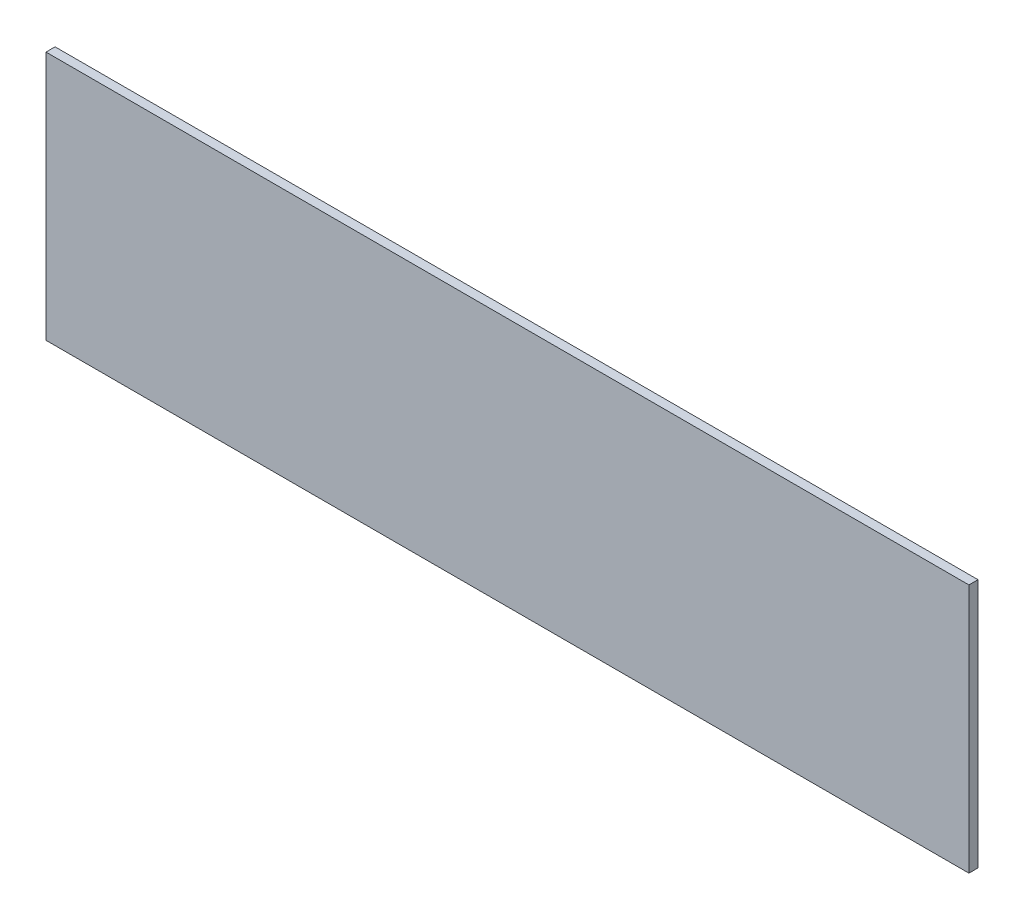
ISO-10303-21;
HEADER;
FILE_DESCRIPTION(('STEP AP214'),'2;1');
FILE_NAME('part.step','',(''),(''),'','','');
FILE_SCHEMA(('AUTOMOTIVE_DESIGN { 1 0 10303 214 1 1 1 1 }'));
ENDSEC;
DATA;
#1=APPLICATION_CONTEXT('core data for automotive mechanical design processes');
#2=APPLICATION_PROTOCOL_DEFINITION('international standard','automotive_design',2000,#1);
#3=PRODUCT_CONTEXT('',#1,'mechanical');
#4=PRODUCT('Part','Part','',(#3));
#5=PRODUCT_RELATED_PRODUCT_CATEGORY('part','',(#4));
#6=PRODUCT_DEFINITION_FORMATION('','',#4);
#7=PRODUCT_DEFINITION_CONTEXT('part definition',#1,'design');
#8=PRODUCT_DEFINITION('design','',#6,#7);
#9=PRODUCT_DEFINITION_SHAPE('','',#8);
#10=(LENGTH_UNIT() NAMED_UNIT(*) SI_UNIT(.MILLI.,.METRE.));
#11=(NAMED_UNIT(*) PLANE_ANGLE_UNIT() SI_UNIT($,.RADIAN.));
#12=(NAMED_UNIT(*) SI_UNIT($,.STERADIAN.) SOLID_ANGLE_UNIT());
#13=UNCERTAINTY_MEASURE_WITH_UNIT(LENGTH_MEASURE(1.E-05),#10,'distance_accuracy_value','');
#14=(GEOMETRIC_REPRESENTATION_CONTEXT(3) GLOBAL_UNCERTAINTY_ASSIGNED_CONTEXT((#13)) GLOBAL_UNIT_ASSIGNED_CONTEXT((#10,
#11,#12)) REPRESENTATION_CONTEXT('',''));
#15=CARTESIAN_POINT('',(0.,0.,0.));
#16=DIRECTION('',(0.,0.,1.));
#17=DIRECTION('',(1.,0.,0.));
#18=AXIS2_PLACEMENT_3D('',#15,#16,#17);
#19=CARTESIAN_POINT('',(0.,0.,3.));
#20=DIRECTION('',(1.,0.,0.));
#21=DIRECTION('',(0.,0.,-1.));
#22=AXIS2_PLACEMENT_3D('',#19,#20,#21);
#23=PLANE('',#22);
#24=DIRECTION('',(0.,-1.,0.));
#25=VECTOR('',#24,1.);
#26=CARTESIAN_POINT('',(0.,0.,0.));
#27=LINE('',#26,#25);
#28=CARTESIAN_POINT('',(0.,82.5,0.));
#29=VERTEX_POINT('',#28);
#30=CARTESIAN_POINT('',(0.,0.,0.));
#31=VERTEX_POINT('',#30);
#32=EDGE_CURVE('E97',#29,#31,#27,.T.);
#33=ORIENTED_EDGE('',*,*,#32,.T.);
#34=DIRECTION('',(0.,0.,-1.));
#35=VECTOR('',#34,1.);
#36=CARTESIAN_POINT('',(0.,0.,3.));
#37=LINE('',#36,#35);
#38=CARTESIAN_POINT('',(0.,0.,3.));
#39=VERTEX_POINT('',#38);
#40=EDGE_CURVE('E11',#39,#31,#37,.T.);
#41=ORIENTED_EDGE('',*,*,#40,.F.);
#42=DIRECTION('',(0.,-1.,0.));
#43=VECTOR('',#42,1.);
#44=CARTESIAN_POINT('',(0.,0.,3.));
#45=LINE('',#44,#43);
#46=CARTESIAN_POINT('',(0.,82.5,3.));
#47=VERTEX_POINT('',#46);
#48=EDGE_CURVE('E85',#47,#39,#45,.T.);
#49=ORIENTED_EDGE('',*,*,#48,.F.);
#50=DIRECTION('',(0.,0.,-1.));
#51=VECTOR('',#50,1.);
#52=CARTESIAN_POINT('',(0.,82.5,3.));
#53=LINE('',#52,#51);
#54=EDGE_CURVE('E93',#47,#29,#53,.T.);
#55=ORIENTED_EDGE('',*,*,#54,.T.);
#56=EDGE_LOOP('',(#33,#41,#49,#55));
#57=FACE_BOUND('',#56,.T.);
#58=ADVANCED_FACE('F34',(#57),#23,.F.);
#59=CARTESIAN_POINT('',(0.,0.,3.));
#60=DIRECTION('',(0.,1.,0.));
#61=DIRECTION('',(0.,0.,1.));
#62=AXIS2_PLACEMENT_3D('',#59,#60,#61);
#63=PLANE('',#62);
#64=DIRECTION('',(1.,0.,0.));
#65=VECTOR('',#64,1.);
#66=CARTESIAN_POINT('',(0.,0.,0.));
#67=LINE('',#66,#65);
#68=CARTESIAN_POINT('',(305.,0.,0.));
#69=VERTEX_POINT('',#68);
#70=EDGE_CURVE('E89',#31,#69,#67,.T.);
#71=ORIENTED_EDGE('',*,*,#70,.T.);
#72=DIRECTION('',(0.,0.,-1.));
#73=VECTOR('',#72,1.);
#74=CARTESIAN_POINT('',(305.,0.,3.));
#75=LINE('',#74,#73);
#76=CARTESIAN_POINT('',(305.,0.,3.));
#77=VERTEX_POINT('',#76);
#78=EDGE_CURVE('E42',#77,#69,#75,.T.);
#79=ORIENTED_EDGE('',*,*,#78,.F.);
#80=DIRECTION('',(1.,0.,0.));
#81=VECTOR('',#80,1.);
#82=CARTESIAN_POINT('',(0.,0.,3.));
#83=LINE('',#82,#81);
#84=EDGE_CURVE('E80',#39,#77,#83,.T.);
#85=ORIENTED_EDGE('',*,*,#84,.F.);
#86=ORIENTED_EDGE('',*,*,#40,.T.);
#87=EDGE_LOOP('',(#71,#79,#85,#86));
#88=FACE_BOUND('',#87,.T.);
#89=ADVANCED_FACE('F88',(#88),#63,.F.);
#90=CARTESIAN_POINT('',(305.,0.,3.));
#91=DIRECTION('',(-1.,0.,0.));
#92=DIRECTION('',(0.,0.,1.));
#93=AXIS2_PLACEMENT_3D('',#90,#91,#92);
#94=PLANE('',#93);
#95=DIRECTION('',(0.,1.,0.));
#96=VECTOR('',#95,1.);
#97=CARTESIAN_POINT('',(305.,0.,0.));
#98=LINE('',#97,#96);
#99=CARTESIAN_POINT('',(305.,82.5,0.));
#100=VERTEX_POINT('',#99);
#101=EDGE_CURVE('E67',#69,#100,#98,.T.);
#102=ORIENTED_EDGE('',*,*,#101,.T.);
#103=DIRECTION('',(0.,0.,-1.));
#104=VECTOR('',#103,1.);
#105=CARTESIAN_POINT('',(305.,82.5,3.));
#106=LINE('',#105,#104);
#107=CARTESIAN_POINT('',(305.,82.5,3.));
#108=VERTEX_POINT('',#107);
#109=EDGE_CURVE('E90',#108,#100,#106,.T.);
#110=ORIENTED_EDGE('',*,*,#109,.F.);
#111=DIRECTION('',(0.,1.,0.));
#112=VECTOR('',#111,1.);
#113=CARTESIAN_POINT('',(305.,0.,3.));
#114=LINE('',#113,#112);
#115=EDGE_CURVE('E83',#77,#108,#114,.T.);
#116=ORIENTED_EDGE('',*,*,#115,.F.);
#117=ORIENTED_EDGE('',*,*,#78,.T.);
#118=EDGE_LOOP('',(#102,#110,#116,#117));
#119=FACE_BOUND('',#118,.T.);
#120=ADVANCED_FACE('F91',(#119),#94,.F.);
#121=CARTESIAN_POINT('',(0.,82.5,3.));
#122=DIRECTION('',(0.,-1.,0.));
#123=DIRECTION('',(0.,0.,-1.));
#124=AXIS2_PLACEMENT_3D('',#121,#122,#123);
#125=PLANE('',#124);
#126=DIRECTION('',(-1.,0.,0.));
#127=VECTOR('',#126,1.);
#128=CARTESIAN_POINT('',(0.,82.5,0.));
#129=LINE('',#128,#127);
#130=EDGE_CURVE('E73',#100,#29,#129,.T.);
#131=ORIENTED_EDGE('',*,*,#130,.T.);
#132=ORIENTED_EDGE('',*,*,#54,.F.);
#133=DIRECTION('',(-1.,0.,0.));
#134=VECTOR('',#133,1.);
#135=CARTESIAN_POINT('',(0.,82.5,3.));
#136=LINE('',#135,#134);
#137=EDGE_CURVE('E50',#108,#47,#136,.T.);
#138=ORIENTED_EDGE('',*,*,#137,.F.);
#139=ORIENTED_EDGE('',*,*,#109,.T.);
#140=EDGE_LOOP('',(#131,#132,#138,#139));
#141=FACE_BOUND('',#140,.T.);
#142=ADVANCED_FACE('F104',(#141),#125,.F.);
#143=CARTESIAN_POINT('',(0.,0.,3.));
#144=DIRECTION('',(0.,0.,-1.));
#145=DIRECTION('',(-1.,0.,0.));
#146=AXIS2_PLACEMENT_3D('',#143,#144,#145);
#147=PLANE('',#146);
#148=ORIENTED_EDGE('',*,*,#48,.T.);
#149=ORIENTED_EDGE('',*,*,#84,.T.);
#150=ORIENTED_EDGE('',*,*,#115,.T.);
#151=ORIENTED_EDGE('',*,*,#137,.T.);
#152=EDGE_LOOP('',(#148,#149,#150,#151));
#153=FACE_BOUND('',#152,.T.);
#154=ADVANCED_FACE('F81',(#153),#147,.F.);
#155=CARTESIAN_POINT('',(0.,0.,0.));
#156=DIRECTION('',(0.,0.,-1.));
#157=DIRECTION('',(-1.,0.,0.));
#158=AXIS2_PLACEMENT_3D('',#155,#156,#157);
#159=PLANE('',#158);
#160=ORIENTED_EDGE('',*,*,#32,.F.);
#161=ORIENTED_EDGE('',*,*,#130,.F.);
#162=ORIENTED_EDGE('',*,*,#101,.F.);
#163=ORIENTED_EDGE('',*,*,#70,.F.);
#164=EDGE_LOOP('',(#160,#161,#162,#163));
#165=FACE_BOUND('',#164,.T.);
#166=ADVANCED_FACE('F107',(#165),#159,.T.);
#167=CLOSED_SHELL('',(#58,#89,#120,#142,#154,#166));
#168=MANIFOLD_SOLID_BREP('B2',#167);
#169=ADVANCED_BREP_SHAPE_REPRESENTATION('',(#18,#168),#14);
#170=SHAPE_DEFINITION_REPRESENTATION(#9,#169);
ENDSEC;
END-ISO-10303-21;
